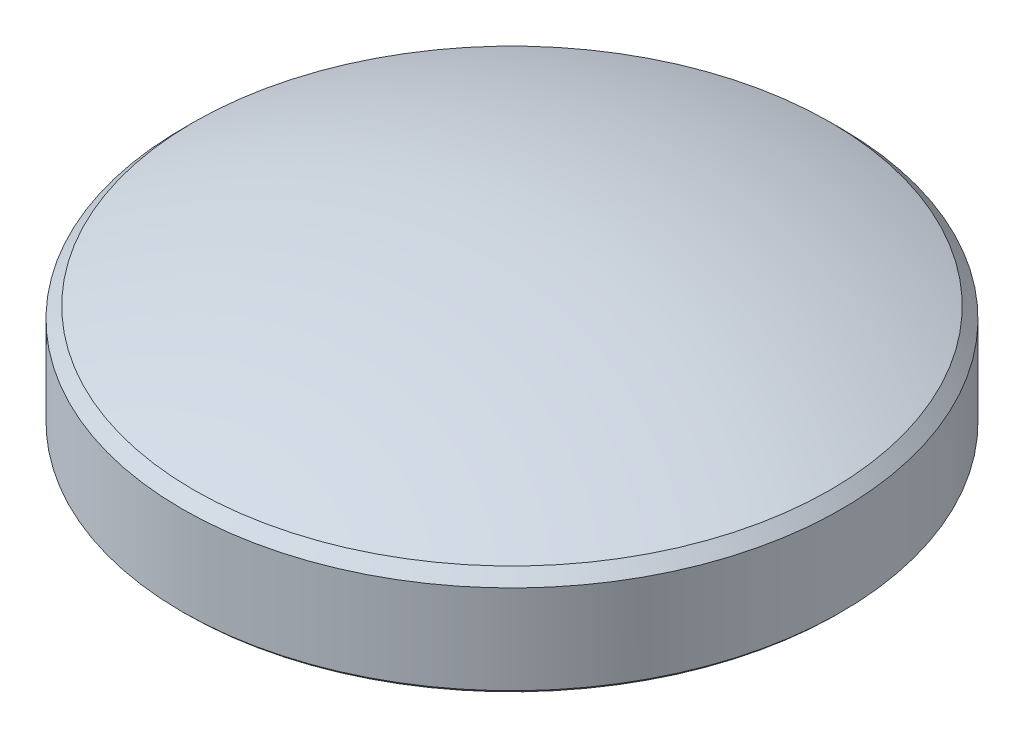
ISO-10303-21;
HEADER;
FILE_DESCRIPTION(('STEP AP214'),'2;1');
FILE_NAME('part.step','',(''),(''),'','','');
FILE_SCHEMA(('AUTOMOTIVE_DESIGN { 1 0 10303 214 1 1 1 1 }'));
ENDSEC;
DATA;
#1=APPLICATION_CONTEXT('core data for automotive mechanical design processes');
#2=APPLICATION_PROTOCOL_DEFINITION('international standard','automotive_design',2000,#1);
#3=PRODUCT_CONTEXT('',#1,'mechanical');
#4=PRODUCT('Part','Part','',(#3));
#5=PRODUCT_RELATED_PRODUCT_CATEGORY('part','',(#4));
#6=PRODUCT_DEFINITION_FORMATION('','',#4);
#7=PRODUCT_DEFINITION_CONTEXT('part definition',#1,'design');
#8=PRODUCT_DEFINITION('design','',#6,#7);
#9=PRODUCT_DEFINITION_SHAPE('','',#8);
#10=(LENGTH_UNIT() NAMED_UNIT(*) SI_UNIT(.MILLI.,.METRE.));
#11=(NAMED_UNIT(*) PLANE_ANGLE_UNIT() SI_UNIT($,.RADIAN.));
#12=(NAMED_UNIT(*) SI_UNIT($,.STERADIAN.) SOLID_ANGLE_UNIT());
#13=UNCERTAINTY_MEASURE_WITH_UNIT(LENGTH_MEASURE(1.E-05),#10,'distance_accuracy_value','');
#14=(GEOMETRIC_REPRESENTATION_CONTEXT(3) GLOBAL_UNCERTAINTY_ASSIGNED_CONTEXT((#13)) GLOBAL_UNIT_ASSIGNED_CONTEXT((#10,
#11,#12)) REPRESENTATION_CONTEXT('',''));
#15=CARTESIAN_POINT('',(0.,0.,0.));
#16=DIRECTION('',(0.,0.,1.));
#17=DIRECTION('',(1.,0.,0.));
#18=AXIS2_PLACEMENT_3D('',#15,#16,#17);
#19=CARTESIAN_POINT('',(0.,-55.4037499999999,0.));
#20=DIRECTION('',(0.,1.,0.));
#21=DIRECTION('',(1.,0.,0.));
#22=AXIS2_PLACEMENT_3D('',#19,#20,#21);
#23=SPHERICAL_SURFACE('',#22,66.0399999999999);
#24=CARTESIAN_POINT('',(0.,5.90700792606471,0.));
#25=DIRECTION('',(0.,-1.,0.));
#26=DIRECTION('',(0.,0.,-1.));
#27=AXIS2_PLACEMENT_3D('',#24,#25,#26);
#28=CIRCLE('',#27,24.5412420739353);
#29=CARTESIAN_POINT('',(0.,5.90700792606471,-24.5412420739353));
#30=VERTEX_POINT('',#29);
#31=EDGE_CURVE('E45',#30,#30,#28,.F.);
#32=ORIENTED_EDGE('',*,*,#31,.T.);
#33=EDGE_LOOP('',(#32));
#34=FACE_BOUND('',#33,.T.);
#35=ADVANCED_FACE('F37',(#34),#23,.T.);
#36=CARTESIAN_POINT('',(0.,18.1500461324618,0.));
#37=DIRECTION('',(0.,1.,0.));
#38=DIRECTION('',(0.,0.,1.));
#39=AXIS2_PLACEMENT_3D('',#36,#37,#38);
#40=CYLINDRICAL_SURFACE('',#39,25.4);
#41=CARTESIAN_POINT('',(0.,5.04824999999996,0.));
#42=DIRECTION('',(0.,-1.,0.));
#43=DIRECTION('',(0.,0.,-1.));
#44=AXIS2_PLACEMENT_3D('',#41,#42,#43);
#45=CIRCLE('',#44,25.4);
#46=CARTESIAN_POINT('',(0.,5.04824999999996,-25.4));
#47=VERTEX_POINT('',#46);
#48=EDGE_CURVE('E10',#47,#47,#45,.T.);
#49=ORIENTED_EDGE('',*,*,#48,.T.);
#50=EDGE_LOOP('',(#49));
#51=FACE_BOUND('',#50,.T.);
#52=CARTESIAN_POINT('',(0.,-1.80975000000001,0.));
#53=DIRECTION('',(0.,1.,0.));
#54=DIRECTION('',(0.,0.,1.));
#55=AXIS2_PLACEMENT_3D('',#52,#53,#54);
#56=CIRCLE('',#55,25.4);
#57=CARTESIAN_POINT('',(0.,-1.80975000000001,25.4));
#58=VERTEX_POINT('',#57);
#59=EDGE_CURVE('E57',#58,#58,#56,.T.);
#60=ORIENTED_EDGE('',*,*,#59,.T.);
#61=EDGE_LOOP('',(#60));
#62=FACE_BOUND('',#61,.T.);
#63=ADVANCED_FACE('F107',(#51,#62),#40,.T.);
#64=CARTESIAN_POINT('',(15.24,-2.06375,0.));
#65=DIRECTION('',(0.,1.,0.));
#66=DIRECTION('',(0.,0.,1.));
#67=AXIS2_PLACEMENT_3D('',#64,#65,#66);
#68=PLANE('',#67);
#69=CARTESIAN_POINT('',(-9.52500000000008,-2.06375,16.4977839420935));
#70=DIRECTION('',(0.,-1.,0.));
#71=DIRECTION('',(0.,0.,-1.));
#72=AXIS2_PLACEMENT_3D('',#69,#70,#71);
#73=CIRCLE('',#72,1.89865);
#74=CARTESIAN_POINT('',(-9.52500000000008,-2.06375,14.5991339420935));
#75=VERTEX_POINT('',#74);
#76=EDGE_CURVE('E88',#75,#75,#73,.T.);
#77=ORIENTED_EDGE('',*,*,#76,.F.);
#78=EDGE_LOOP('',(#77));
#79=FACE_BOUND('',#78,.T.);
#80=CARTESIAN_POINT('',(-9.52500000000008,-2.06375,-16.4977839420935));
#81=DIRECTION('',(0.,-1.,0.));
#82=DIRECTION('',(0.,0.,1.));
#83=AXIS2_PLACEMENT_3D('',#80,#81,#82);
#84=CIRCLE('',#83,1.89865);
#85=CARTESIAN_POINT('',(-9.52500000000008,-2.06375,-14.5991339420935));
#86=VERTEX_POINT('',#85);
#87=EDGE_CURVE('E82',#86,#86,#84,.T.);
#88=ORIENTED_EDGE('',*,*,#87,.F.);
#89=EDGE_LOOP('',(#88));
#90=FACE_BOUND('',#89,.T.);
#91=CARTESIAN_POINT('',(19.05,-2.06375,0.));
#92=DIRECTION('',(0.,-1.,0.));
#93=DIRECTION('',(0.,0.,-1.));
#94=AXIS2_PLACEMENT_3D('',#91,#92,#93);
#95=CIRCLE('',#94,1.89865);
#96=CARTESIAN_POINT('',(19.05,-2.06375,-1.89865));
#97=VERTEX_POINT('',#96);
#98=EDGE_CURVE('E76',#97,#97,#95,.T.);
#99=ORIENTED_EDGE('',*,*,#98,.F.);
#100=EDGE_LOOP('',(#99));
#101=FACE_BOUND('',#100,.T.);
#102=CARTESIAN_POINT('',(0.,-2.06375,0.));
#103=DIRECTION('',(0.,1.,0.));
#104=DIRECTION('',(0.,0.,1.));
#105=AXIS2_PLACEMENT_3D('',#102,#103,#104);
#106=CIRCLE('',#105,25.146);
#107=CARTESIAN_POINT('',(0.,-2.06375,25.146));
#108=VERTEX_POINT('',#107);
#109=EDGE_CURVE('E51',#108,#108,#106,.F.);
#110=ORIENTED_EDGE('',*,*,#109,.T.);
#111=EDGE_LOOP('',(#110));
#112=FACE_BOUND('',#111,.T.);
#113=CARTESIAN_POINT('',(0.,-2.06375,0.));
#114=DIRECTION('',(0.,1.,0.));
#115=DIRECTION('',(0.,0.,1.));
#116=AXIS2_PLACEMENT_3D('',#113,#114,#115);
#117=CIRCLE('',#116,15.24);
#118=CARTESIAN_POINT('',(0.,-2.06375,15.24));
#119=VERTEX_POINT('',#118);
#120=EDGE_CURVE('E62',#119,#119,#117,.T.);
#121=ORIENTED_EDGE('',*,*,#120,.T.);
#122=EDGE_LOOP('',(#121));
#123=FACE_BOUND('',#122,.T.);
#124=ADVANCED_FACE('F103',(#79,#90,#101,#112,#123),#68,.F.);
#125=CARTESIAN_POINT('',(0.,0.,0.));
#126=DIRECTION('',(0.,-1.,0.));
#127=DIRECTION('',(0.,0.,-1.));
#128=AXIS2_PLACEMENT_3D('',#125,#126,#127);
#129=CONICAL_SURFACE('',#128,13.17625,0.785398163397447);
#130=ORIENTED_EDGE('',*,*,#120,.F.);
#131=EDGE_LOOP('',(#130));
#132=FACE_BOUND('',#131,.T.);
#133=CARTESIAN_POINT('',(0.,0.,0.));
#134=DIRECTION('',(0.,1.,0.));
#135=DIRECTION('',(0.,0.,1.));
#136=AXIS2_PLACEMENT_3D('',#133,#134,#135);
#137=CIRCLE('',#136,13.17625);
#138=CARTESIAN_POINT('',(0.,0.,13.17625));
#139=VERTEX_POINT('',#138);
#140=EDGE_CURVE('E65',#139,#139,#137,.T.);
#141=ORIENTED_EDGE('',*,*,#140,.T.);
#142=EDGE_LOOP('',(#141));
#143=FACE_BOUND('',#142,.T.);
#144=ADVANCED_FACE('F106',(#132,#143),#129,.F.);
#145=CARTESIAN_POINT('',(4.365625,0.,0.));
#146=DIRECTION('',(0.,1.,0.));
#147=DIRECTION('',(0.,0.,1.));
#148=AXIS2_PLACEMENT_3D('',#145,#146,#147);
#149=PLANE('',#148);
#150=ORIENTED_EDGE('',*,*,#140,.F.);
#151=EDGE_LOOP('',(#150));
#152=FACE_BOUND('',#151,.T.);
#153=CARTESIAN_POINT('',(0.,0.,0.));
#154=DIRECTION('',(0.,1.,0.));
#155=DIRECTION('',(0.,0.,1.));
#156=AXIS2_PLACEMENT_3D('',#153,#154,#155);
#157=CIRCLE('',#156,4.365625);
#158=CARTESIAN_POINT('',(0.,0.,4.365625));
#159=VERTEX_POINT('',#158);
#160=EDGE_CURVE('E69',#159,#159,#157,.T.);
#161=ORIENTED_EDGE('',*,*,#160,.T.);
#162=EDGE_LOOP('',(#161));
#163=FACE_BOUND('',#162,.T.);
#164=ADVANCED_FACE('F119',(#152,#163),#149,.F.);
#165=CARTESIAN_POINT('',(0.,18.1500461324618,0.));
#166=DIRECTION('',(0.,1.,0.));
#167=DIRECTION('',(0.,0.,1.));
#168=AXIS2_PLACEMENT_3D('',#165,#166,#167);
#169=CYLINDRICAL_SURFACE('',#168,4.365625);
#170=ORIENTED_EDGE('',*,*,#160,.F.);
#171=EDGE_LOOP('',(#170));
#172=FACE_BOUND('',#171,.T.);
#173=CARTESIAN_POINT('',(0.,5.55625,0.));
#174=DIRECTION('',(0.,1.,0.));
#175=DIRECTION('',(0.,0.,1.));
#176=AXIS2_PLACEMENT_3D('',#173,#174,#175);
#177=CIRCLE('',#176,4.365625);
#178=CARTESIAN_POINT('',(0.,5.55625,4.365625));
#179=VERTEX_POINT('',#178);
#180=EDGE_CURVE('E72',#179,#179,#177,.T.);
#181=ORIENTED_EDGE('',*,*,#180,.T.);
#182=EDGE_LOOP('',(#181));
#183=FACE_BOUND('',#182,.T.);
#184=ADVANCED_FACE('F125',(#172,#183),#169,.F.);
#185=CARTESIAN_POINT('',(0.,5.55625,0.));
#186=DIRECTION('',(0.,1.,0.));
#187=DIRECTION('',(0.,0.,1.));
#188=AXIS2_PLACEMENT_3D('',#185,#186,#187);
#189=PLANE('',#188);
#190=ORIENTED_EDGE('',*,*,#180,.F.);
#191=EDGE_LOOP('',(#190));
#192=FACE_BOUND('',#191,.T.);
#193=ADVANCED_FACE('F131',(#192),#189,.F.);
#194=CARTESIAN_POINT('',(0.,-1.80975000000001,0.));
#195=DIRECTION('',(0.,1.,0.));
#196=DIRECTION('',(0.,0.,1.));
#197=AXIS2_PLACEMENT_3D('',#194,#195,#196);
#198=CONICAL_SURFACE('',#197,25.4,0.785398163397442);
#199=ORIENTED_EDGE('',*,*,#109,.F.);
#200=EDGE_LOOP('',(#199));
#201=FACE_BOUND('',#200,.T.);
#202=ORIENTED_EDGE('',*,*,#59,.F.);
#203=EDGE_LOOP('',(#202));
#204=FACE_BOUND('',#203,.T.);
#205=ADVANCED_FACE('F136',(#201,#204),#198,.T.);
#206=CARTESIAN_POINT('',(0.,5.90700792606474,0.));
#207=DIRECTION('',(0.,-1.,0.));
#208=DIRECTION('',(0.,0.,-1.));
#209=AXIS2_PLACEMENT_3D('',#206,#207,#208);
#210=CONICAL_SURFACE('',#209,24.5412420739352,0.785398163397434);
#211=ORIENTED_EDGE('',*,*,#48,.F.);
#212=EDGE_LOOP('',(#211));
#213=FACE_BOUND('',#212,.T.);
#214=ORIENTED_EDGE('',*,*,#31,.F.);
#215=EDGE_LOOP('',(#214));
#216=FACE_BOUND('',#215,.T.);
#217=ADVANCED_FACE('F39',(#213,#216),#210,.T.);
#218=CARTESIAN_POINT('',(19.05,3.01625,0.));
#219=DIRECTION('',(0.,-1.,0.));
#220=DIRECTION('',(0.,0.,-1.));
#221=AXIS2_PLACEMENT_3D('',#218,#219,#220);
#222=CYLINDRICAL_SURFACE('',#221,1.89865);
#223=CARTESIAN_POINT('',(19.05,3.01625,0.));
#224=DIRECTION('',(0.,-1.,0.));
#225=DIRECTION('',(0.,0.,-1.));
#226=AXIS2_PLACEMENT_3D('',#223,#224,#225);
#227=CIRCLE('',#226,1.89865);
#228=CARTESIAN_POINT('',(19.05,3.01625,-1.89865));
#229=VERTEX_POINT('',#228);
#230=EDGE_CURVE('E75',#229,#229,#227,.T.);
#231=ORIENTED_EDGE('',*,*,#230,.F.);
#232=EDGE_LOOP('',(#231));
#233=FACE_BOUND('',#232,.T.);
#234=ORIENTED_EDGE('',*,*,#98,.T.);
#235=EDGE_LOOP('',(#234));
#236=FACE_BOUND('',#235,.T.);
#237=ADVANCED_FACE('F197',(#233,#236),#222,.F.);
#238=CARTESIAN_POINT('',(19.05,3.01625,0.));
#239=DIRECTION('',(0.,-1.,0.));
#240=DIRECTION('',(0.,0.,-1.));
#241=AXIS2_PLACEMENT_3D('',#238,#239,#240);
#242=PLANE('',#241);
#243=ORIENTED_EDGE('',*,*,#230,.T.);
#244=EDGE_LOOP('',(#243));
#245=FACE_BOUND('',#244,.T.);
#246=ADVANCED_FACE('F210',(#245),#242,.T.);
#247=CARTESIAN_POINT('',(-9.52500000000008,3.01625,-16.4977839420935));
#248=DIRECTION('',(0.,-1.,0.));
#249=DIRECTION('',(0.,0.,-1.));
#250=AXIS2_PLACEMENT_3D('',#247,#248,#249);
#251=CYLINDRICAL_SURFACE('',#250,1.89865);
#252=CARTESIAN_POINT('',(-9.52500000000008,3.01625,-16.4977839420935));
#253=DIRECTION('',(0.,-1.,0.));
#254=DIRECTION('',(0.,0.,1.));
#255=AXIS2_PLACEMENT_3D('',#252,#253,#254);
#256=CIRCLE('',#255,1.89865);
#257=CARTESIAN_POINT('',(-9.52500000000008,3.01625,-14.5991339420935));
#258=VERTEX_POINT('',#257);
#259=EDGE_CURVE('E85',#258,#258,#256,.T.);
#260=ORIENTED_EDGE('',*,*,#259,.F.);
#261=EDGE_LOOP('',(#260));
#262=FACE_BOUND('',#261,.T.);
#263=ORIENTED_EDGE('',*,*,#87,.T.);
#264=EDGE_LOOP('',(#263));
#265=FACE_BOUND('',#264,.T.);
#266=ADVANCED_FACE('F219',(#262,#265),#251,.F.);
#267=CARTESIAN_POINT('',(-9.52500000000008,3.01625,-16.4977839420935));
#268=DIRECTION('',(0.,1.,0.));
#269=DIRECTION('',(0.,0.,1.));
#270=AXIS2_PLACEMENT_3D('',#267,#268,#269);
#271=PLANE('',#270);
#272=ORIENTED_EDGE('',*,*,#259,.T.);
#273=EDGE_LOOP('',(#272));
#274=FACE_BOUND('',#273,.T.);
#275=ADVANCED_FACE('F99',(#274),#271,.F.);
#276=CARTESIAN_POINT('',(-9.52500000000008,3.01625,16.4977839420935));
#277=DIRECTION('',(0.,-1.,0.));
#278=DIRECTION('',(0.,0.,-1.));
#279=AXIS2_PLACEMENT_3D('',#276,#277,#278);
#280=CYLINDRICAL_SURFACE('',#279,1.89865);
#281=CARTESIAN_POINT('',(-9.52500000000008,3.01625,16.4977839420935));
#282=DIRECTION('',(0.,-1.,0.));
#283=DIRECTION('',(0.,0.,-1.));
#284=AXIS2_PLACEMENT_3D('',#281,#282,#283);
#285=CIRCLE('',#284,1.89865);
#286=CARTESIAN_POINT('',(-9.52500000000008,3.01625,14.5991339420935));
#287=VERTEX_POINT('',#286);
#288=EDGE_CURVE('E79',#287,#287,#285,.T.);
#289=ORIENTED_EDGE('',*,*,#288,.F.);
#290=EDGE_LOOP('',(#289));
#291=FACE_BOUND('',#290,.T.);
#292=ORIENTED_EDGE('',*,*,#76,.T.);
#293=EDGE_LOOP('',(#292));
#294=FACE_BOUND('',#293,.T.);
#295=ADVANCED_FACE('F96',(#291,#294),#280,.F.);
#296=CARTESIAN_POINT('',(-9.52500000000008,3.01625,16.4977839420935));
#297=DIRECTION('',(0.,-1.,0.));
#298=DIRECTION('',(0.,0.,-1.));
#299=AXIS2_PLACEMENT_3D('',#296,#297,#298);
#300=PLANE('',#299);
#301=ORIENTED_EDGE('',*,*,#288,.T.);
#302=EDGE_LOOP('',(#301));
#303=FACE_BOUND('',#302,.T.);
#304=ADVANCED_FACE('F94',(#303),#300,.T.);
#305=CLOSED_SHELL('',(#35,#63,#124,#144,#164,#184,#193,#205,#217,#237,#246,#266,#275,#295,#304));
#306=MANIFOLD_SOLID_BREP('B2',#305);
#307=ADVANCED_BREP_SHAPE_REPRESENTATION('',(#18,#306),#14);
#308=SHAPE_DEFINITION_REPRESENTATION(#9,#307);
ENDSEC;
END-ISO-10303-21;
